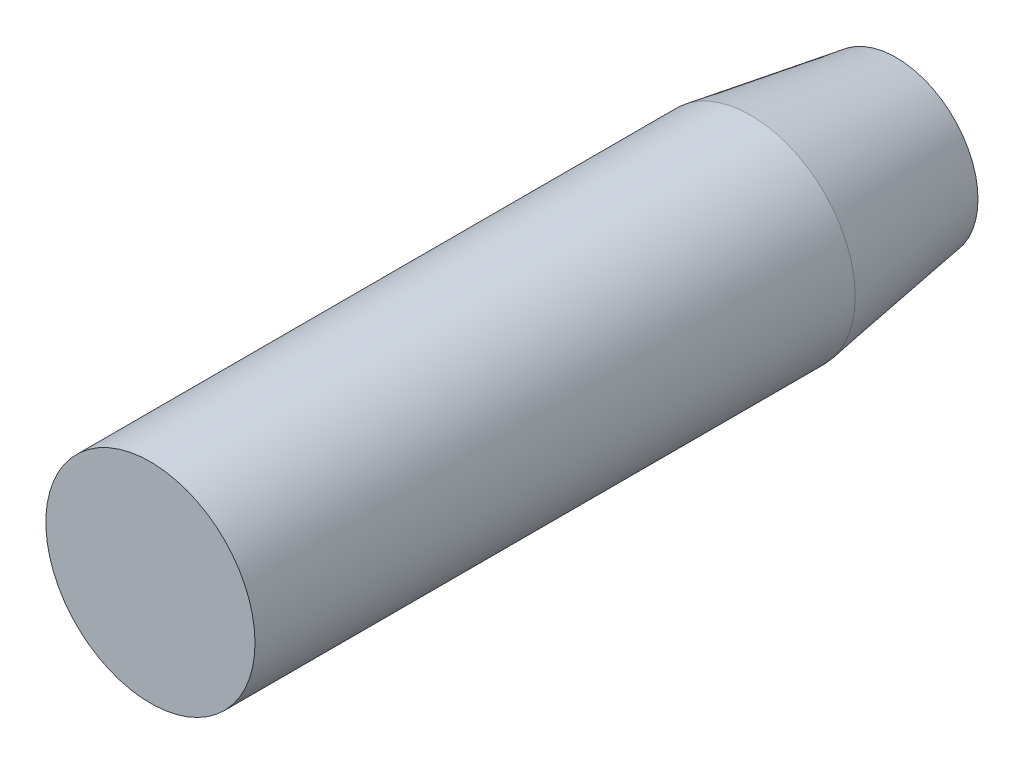
ISO-10303-21;
HEADER;
FILE_DESCRIPTION(('STEP AP214'),'2;1');
FILE_NAME('part.step','',(''),(''),'','','');
FILE_SCHEMA(('AUTOMOTIVE_DESIGN { 1 0 10303 214 1 1 1 1 }'));
ENDSEC;
DATA;
#1=APPLICATION_CONTEXT('core data for automotive mechanical design processes');
#2=APPLICATION_PROTOCOL_DEFINITION('international standard','automotive_design',2000,#1);
#3=PRODUCT_CONTEXT('',#1,'mechanical');
#4=PRODUCT('Part','Part','',(#3));
#5=PRODUCT_RELATED_PRODUCT_CATEGORY('part','',(#4));
#6=PRODUCT_DEFINITION_FORMATION('','',#4);
#7=PRODUCT_DEFINITION_CONTEXT('part definition',#1,'design');
#8=PRODUCT_DEFINITION('design','',#6,#7);
#9=PRODUCT_DEFINITION_SHAPE('','',#8);
#10=(LENGTH_UNIT() NAMED_UNIT(*) SI_UNIT(.MILLI.,.METRE.));
#11=(NAMED_UNIT(*) PLANE_ANGLE_UNIT() SI_UNIT($,.RADIAN.));
#12=(NAMED_UNIT(*) SI_UNIT($,.STERADIAN.) SOLID_ANGLE_UNIT());
#13=UNCERTAINTY_MEASURE_WITH_UNIT(LENGTH_MEASURE(1.E-05),#10,'distance_accuracy_value','');
#14=(GEOMETRIC_REPRESENTATION_CONTEXT(3) GLOBAL_UNCERTAINTY_ASSIGNED_CONTEXT((#13)) GLOBAL_UNIT_ASSIGNED_CONTEXT((#10,
#11,#12)) REPRESENTATION_CONTEXT('',''));
#15=CARTESIAN_POINT('',(0.,0.,0.));
#16=DIRECTION('',(0.,0.,1.));
#17=DIRECTION('',(1.,0.,0.));
#18=AXIS2_PLACEMENT_3D('',#15,#16,#17);
#19=CARTESIAN_POINT('',(0.,0.,-65.0875));
#20=DIRECTION('',(0.,0.,1.));
#21=DIRECTION('',(-1.,0.,0.));
#22=AXIS2_PLACEMENT_3D('',#19,#20,#21);
#23=CYLINDRICAL_SURFACE('',#22,18.25625);
#24=CARTESIAN_POINT('',(0.,0.,-39.6874999999998));
#25=DIRECTION('',(0.,0.,1.));
#26=DIRECTION('',(1.,0.,0.));
#27=AXIS2_PLACEMENT_3D('',#24,#25,#26);
#28=CIRCLE('',#27,18.25625);
#29=CARTESIAN_POINT('',(18.25625,0.,-39.6874999999998));
#30=VERTEX_POINT('',#29);
#31=EDGE_CURVE('E10',#30,#30,#28,.F.);
#32=ORIENTED_EDGE('',*,*,#31,.F.);
#33=EDGE_LOOP('',(#32));
#34=FACE_BOUND('',#33,.T.);
#35=CARTESIAN_POINT('',(0.,0.,65.0875));
#36=DIRECTION('',(0.,0.,1.));
#37=DIRECTION('',(1.,0.,0.));
#38=AXIS2_PLACEMENT_3D('',#35,#36,#37);
#39=CIRCLE('',#38,18.25625);
#40=CARTESIAN_POINT('',(18.25625,0.,65.0875));
#41=VERTEX_POINT('',#40);
#42=EDGE_CURVE('E55',#41,#41,#39,.T.);
#43=ORIENTED_EDGE('',*,*,#42,.F.);
#44=EDGE_LOOP('',(#43));
#45=FACE_BOUND('',#44,.T.);
#46=ADVANCED_FACE('F41',(#34,#45),#23,.T.);
#47=CARTESIAN_POINT('',(0.,0.,-65.0875));
#48=DIRECTION('',(0.,0.,-1.));
#49=DIRECTION('',(1.,0.,0.));
#50=AXIS2_PLACEMENT_3D('',#47,#48,#49);
#51=PLANE('',#50);
#52=CARTESIAN_POINT('',(0.,0.,-65.0875));
#53=DIRECTION('',(0.,0.,1.));
#54=DIRECTION('',(1.,0.,0.));
#55=AXIS2_PLACEMENT_3D('',#52,#53,#54);
#56=CIRCLE('',#55,14.2875000000001);
#57=CARTESIAN_POINT('',(14.2875000000001,0.,-65.0875));
#58=VERTEX_POINT('',#57);
#59=EDGE_CURVE('E49',#58,#58,#56,.T.);
#60=ORIENTED_EDGE('',*,*,#59,.F.);
#61=EDGE_LOOP('',(#60));
#62=FACE_BOUND('',#61,.T.);
#63=ADVANCED_FACE('F65',(#62),#51,.T.);
#64=CARTESIAN_POINT('',(0.,0.,65.0875));
#65=DIRECTION('',(0.,0.,-1.));
#66=DIRECTION('',(1.,0.,0.));
#67=AXIS2_PLACEMENT_3D('',#64,#65,#66);
#68=PLANE('',#67);
#69=ORIENTED_EDGE('',*,*,#42,.T.);
#70=EDGE_LOOP('',(#69));
#71=FACE_BOUND('',#70,.T.);
#72=ADVANCED_FACE('F62',(#71),#68,.F.);
#73=CARTESIAN_POINT('',(0.,0.,-65.0875));
#74=DIRECTION('',(0.,0.,1.));
#75=DIRECTION('',(-1.,0.,0.));
#76=AXIS2_PLACEMENT_3D('',#73,#74,#75);
#77=CONICAL_SURFACE('',#76,14.2875000000001,0.154996741923938);
#78=ORIENTED_EDGE('',*,*,#31,.T.);
#79=EDGE_LOOP('',(#78));
#80=FACE_BOUND('',#79,.T.);
#81=ORIENTED_EDGE('',*,*,#59,.T.);
#82=EDGE_LOOP('',(#81));
#83=FACE_BOUND('',#82,.T.);
#84=ADVANCED_FACE('F43',(#80,#83),#77,.T.);
#85=CLOSED_SHELL('',(#46,#63,#72,#84));
#86=MANIFOLD_SOLID_BREP('B2',#85);
#87=ADVANCED_BREP_SHAPE_REPRESENTATION('',(#18,#86),#14);
#88=SHAPE_DEFINITION_REPRESENTATION(#9,#87);
ENDSEC;
END-ISO-10303-21;
